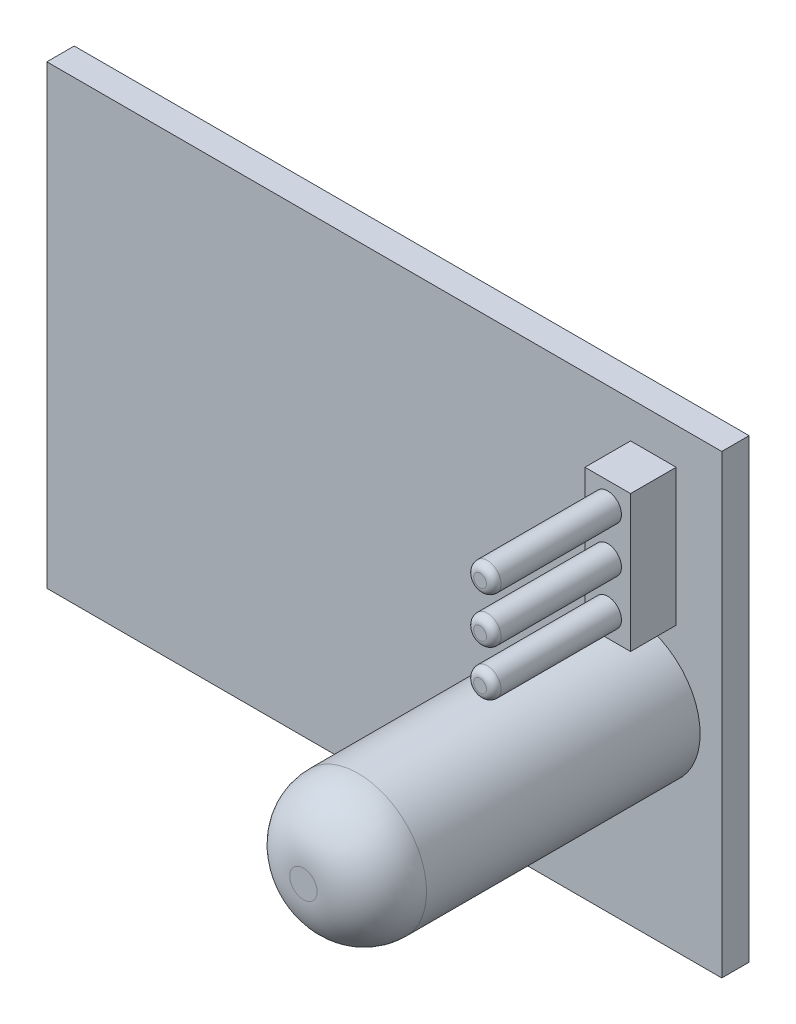
ISO-10303-21;
HEADER;
FILE_DESCRIPTION(('STEP AP214'),'2;1');
FILE_NAME('part.step','',(''),(''),'','','');
FILE_SCHEMA(('AUTOMOTIVE_DESIGN { 1 0 10303 214 1 1 1 1 }'));
ENDSEC;
DATA;
#1=APPLICATION_CONTEXT('core data for automotive mechanical design processes');
#2=APPLICATION_PROTOCOL_DEFINITION('international standard','automotive_design',2000,#1);
#3=PRODUCT_CONTEXT('',#1,'mechanical');
#4=PRODUCT('Part','Part','',(#3));
#5=PRODUCT_RELATED_PRODUCT_CATEGORY('part','',(#4));
#6=PRODUCT_DEFINITION_FORMATION('','',#4);
#7=PRODUCT_DEFINITION_CONTEXT('part definition',#1,'design');
#8=PRODUCT_DEFINITION('design','',#6,#7);
#9=PRODUCT_DEFINITION_SHAPE('','',#8);
#10=(LENGTH_UNIT() NAMED_UNIT(*) SI_UNIT(.MILLI.,.METRE.));
#11=(NAMED_UNIT(*) PLANE_ANGLE_UNIT() SI_UNIT($,.RADIAN.));
#12=(NAMED_UNIT(*) SI_UNIT($,.STERADIAN.) SOLID_ANGLE_UNIT());
#13=UNCERTAINTY_MEASURE_WITH_UNIT(LENGTH_MEASURE(1.E-05),#10,'distance_accuracy_value','');
#14=(GEOMETRIC_REPRESENTATION_CONTEXT(3) GLOBAL_UNCERTAINTY_ASSIGNED_CONTEXT((#13)) GLOBAL_UNIT_ASSIGNED_CONTEXT((#10,
#11,#12)) REPRESENTATION_CONTEXT('',''));
#15=CARTESIAN_POINT('',(0.,0.,0.));
#16=DIRECTION('',(0.,0.,1.));
#17=DIRECTION('',(1.,0.,0.));
#18=AXIS2_PLACEMENT_3D('',#15,#16,#17);
#19=CARTESIAN_POINT('',(0.,0.,4.));
#20=DIRECTION('',(0.,0.,1.));
#21=DIRECTION('',(1.,0.,0.));
#22=AXIS2_PLACEMENT_3D('',#19,#20,#21);
#23=PLANE('',#22);
#24=CARTESIAN_POINT('',(14.75,9.25000000000001,4.));
#25=DIRECTION('',(0.,0.,1.));
#26=DIRECTION('',(1.,0.,0.));
#27=AXIS2_PLACEMENT_3D('',#24,#25,#26);
#28=CIRCLE('',#27,0.75);
#29=CARTESIAN_POINT('',(15.5,9.25000000000001,4.));
#30=VERTEX_POINT('',#29);
#31=EDGE_CURVE('E412',#30,#30,#28,.T.);
#32=ORIENTED_EDGE('',*,*,#31,.F.);
#33=EDGE_LOOP('',(#32));
#34=FACE_BOUND('',#33,.T.);
#35=DIRECTION('',(0.,1.,0.));
#36=VECTOR('',#35,1.);
#37=CARTESIAN_POINT('',(16.,10.5,4.));
#38=LINE('',#37,#36);
#39=CARTESIAN_POINT('',(16.,3.,4.));
#40=VERTEX_POINT('',#39);
#41=CARTESIAN_POINT('',(16.,10.5,4.));
#42=VERTEX_POINT('',#41);
#43=EDGE_CURVE('E119',#40,#42,#38,.T.);
#44=ORIENTED_EDGE('',*,*,#43,.T.);
#45=DIRECTION('',(-1.,0.,0.));
#46=VECTOR('',#45,1.);
#47=CARTESIAN_POINT('',(13.5,10.5,4.));
#48=LINE('',#47,#46);
#49=CARTESIAN_POINT('',(13.5,10.5,4.));
#50=VERTEX_POINT('',#49);
#51=EDGE_CURVE('E108',#42,#50,#48,.T.);
#52=ORIENTED_EDGE('',*,*,#51,.T.);
#53=DIRECTION('',(0.,-1.,0.));
#54=VECTOR('',#53,1.);
#55=CARTESIAN_POINT('',(13.5,10.5,4.));
#56=LINE('',#55,#54);
#57=CARTESIAN_POINT('',(13.5,3.,4.));
#58=VERTEX_POINT('',#57);
#59=EDGE_CURVE('E118',#50,#58,#56,.T.);
#60=ORIENTED_EDGE('',*,*,#59,.T.);
#61=DIRECTION('',(1.,0.,0.));
#62=VECTOR('',#61,1.);
#63=CARTESIAN_POINT('',(13.5,3.,4.));
#64=LINE('',#63,#62);
#65=EDGE_CURVE('E123',#58,#40,#64,.T.);
#66=ORIENTED_EDGE('',*,*,#65,.T.);
#67=EDGE_LOOP('',(#44,#52,#60,#66));
#68=FACE_BOUND('',#67,.T.);
#69=CARTESIAN_POINT('',(14.75,6.75,4.));
#70=DIRECTION('',(0.,0.,1.));
#71=DIRECTION('',(1.,0.,0.));
#72=AXIS2_PLACEMENT_3D('',#69,#70,#71);
#73=CIRCLE('',#72,0.75);
#74=CARTESIAN_POINT('',(15.5,6.75,4.));
#75=VERTEX_POINT('',#74);
#76=EDGE_CURVE('E413',#75,#75,#73,.T.);
#77=ORIENTED_EDGE('',*,*,#76,.F.);
#78=EDGE_LOOP('',(#77));
#79=FACE_BOUND('',#78,.T.);
#80=CARTESIAN_POINT('',(14.75,4.25,4.));
#81=DIRECTION('',(0.,0.,1.));
#82=DIRECTION('',(1.,0.,0.));
#83=AXIS2_PLACEMENT_3D('',#80,#81,#82);
#84=CIRCLE('',#83,0.75);
#85=CARTESIAN_POINT('',(15.5,4.25,4.));
#86=VERTEX_POINT('',#85);
#87=EDGE_CURVE('E169',#86,#86,#84,.T.);
#88=ORIENTED_EDGE('',*,*,#87,.F.);
#89=EDGE_LOOP('',(#88));
#90=FACE_BOUND('',#89,.T.);
#91=ADVANCED_FACE('F33',(#34,#68,#79,#90),#23,.T.);
#92=CARTESIAN_POINT('',(0.,0.,1.5));
#93=DIRECTION('',(0.,0.,1.));
#94=DIRECTION('',(1.,0.,0.));
#95=AXIS2_PLACEMENT_3D('',#92,#93,#94);
#96=PLANE('',#95);
#97=CARTESIAN_POINT('',(13.5646679125898,-1.5,1.5));
#98=DIRECTION('',(0.,0.,1.));
#99=DIRECTION('',(1.,0.,0.));
#100=AXIS2_PLACEMENT_3D('',#97,#98,#99);
#101=CIRCLE('',#100,3.75);
#102=CARTESIAN_POINT('',(17.3146679125898,-1.5,1.5));
#103=VERTEX_POINT('',#102);
#104=EDGE_CURVE('E133',#103,#103,#101,.T.);
#105=ORIENTED_EDGE('',*,*,#104,.F.);
#106=EDGE_LOOP('',(#105));
#107=FACE_BOUND('',#106,.T.);
#108=DIRECTION('',(0.,-1.,0.));
#109=VECTOR('',#108,1.);
#110=CARTESIAN_POINT('',(-18.5,-12.5,1.5));
#111=LINE('',#110,#109);
#112=CARTESIAN_POINT('',(-18.5,12.5,1.5));
#113=VERTEX_POINT('',#112);
#114=CARTESIAN_POINT('',(-18.5,-12.5,1.5));
#115=VERTEX_POINT('',#114);
#116=EDGE_CURVE('E141',#113,#115,#111,.T.);
#117=ORIENTED_EDGE('',*,*,#116,.T.);
#118=DIRECTION('',(1.,0.,0.));
#119=VECTOR('',#118,1.);
#120=CARTESIAN_POINT('',(18.5,-12.5,1.5));
#121=LINE('',#120,#119);
#122=CARTESIAN_POINT('',(18.5,-12.5,1.5));
#123=VERTEX_POINT('',#122);
#124=EDGE_CURVE('E86',#115,#123,#121,.T.);
#125=ORIENTED_EDGE('',*,*,#124,.T.);
#126=DIRECTION('',(0.,1.,0.));
#127=VECTOR('',#126,1.);
#128=CARTESIAN_POINT('',(18.5,-12.5,1.5));
#129=LINE('',#128,#127);
#130=CARTESIAN_POINT('',(18.5,12.5,1.5));
#131=VERTEX_POINT('',#130);
#132=EDGE_CURVE('E144',#123,#131,#129,.T.);
#133=ORIENTED_EDGE('',*,*,#132,.T.);
#134=DIRECTION('',(-1.,0.,0.));
#135=VECTOR('',#134,1.);
#136=CARTESIAN_POINT('',(18.5,12.5,1.5));
#137=LINE('',#136,#135);
#138=EDGE_CURVE('E57',#131,#113,#137,.T.);
#139=ORIENTED_EDGE('',*,*,#138,.T.);
#140=EDGE_LOOP('',(#117,#125,#133,#139));
#141=FACE_BOUND('',#140,.T.);
#142=DIRECTION('',(-1.,0.,0.));
#143=VECTOR('',#142,1.);
#144=CARTESIAN_POINT('',(13.5,10.5,1.5));
#145=LINE('',#144,#143);
#146=CARTESIAN_POINT('',(16.,10.5,1.5));
#147=VERTEX_POINT('',#146);
#148=CARTESIAN_POINT('',(13.5,10.5,1.5));
#149=VERTEX_POINT('',#148);
#150=EDGE_CURVE('E415',#147,#149,#145,.T.);
#151=ORIENTED_EDGE('',*,*,#150,.F.);
#152=DIRECTION('',(0.,1.,0.));
#153=VECTOR('',#152,1.);
#154=CARTESIAN_POINT('',(16.,10.5,1.5));
#155=LINE('',#154,#153);
#156=CARTESIAN_POINT('',(16.,3.,1.5));
#157=VERTEX_POINT('',#156);
#158=EDGE_CURVE('E131',#157,#147,#155,.T.);
#159=ORIENTED_EDGE('',*,*,#158,.F.);
#160=DIRECTION('',(1.,0.,0.));
#161=VECTOR('',#160,1.);
#162=CARTESIAN_POINT('',(13.5,3.,1.5));
#163=LINE('',#162,#161);
#164=CARTESIAN_POINT('',(13.5,3.,1.5));
#165=VERTEX_POINT('',#164);
#166=EDGE_CURVE('E127',#165,#157,#163,.T.);
#167=ORIENTED_EDGE('',*,*,#166,.F.);
#168=DIRECTION('',(0.,-1.,0.));
#169=VECTOR('',#168,1.);
#170=CARTESIAN_POINT('',(13.5,10.5,1.5));
#171=LINE('',#170,#169);
#172=EDGE_CURVE('E424',#149,#165,#171,.T.);
#173=ORIENTED_EDGE('',*,*,#172,.F.);
#174=EDGE_LOOP('',(#151,#159,#167,#173));
#175=FACE_BOUND('',#174,.T.);
#176=ADVANCED_FACE('F198',(#107,#141,#175),#96,.T.);
#177=CARTESIAN_POINT('',(-18.5,-12.5,1.5));
#178=DIRECTION('',(1.,0.,0.));
#179=DIRECTION('',(0.,0.,-1.));
#180=AXIS2_PLACEMENT_3D('',#177,#178,#179);
#181=PLANE('',#180);
#182=DIRECTION('',(0.,-1.,0.));
#183=VECTOR('',#182,1.);
#184=CARTESIAN_POINT('',(-18.5,-12.5,0.));
#185=LINE('',#184,#183);
#186=CARTESIAN_POINT('',(-18.5,12.5,0.));
#187=VERTEX_POINT('',#186);
#188=CARTESIAN_POINT('',(-18.5,-12.5,0.));
#189=VERTEX_POINT('',#188);
#190=EDGE_CURVE('E136',#187,#189,#185,.T.);
#191=ORIENTED_EDGE('',*,*,#190,.T.);
#192=DIRECTION('',(0.,0.,-1.));
#193=VECTOR('',#192,1.);
#194=CARTESIAN_POINT('',(-18.5,-12.5,1.5));
#195=LINE('',#194,#193);
#196=EDGE_CURVE('E161',#115,#189,#195,.T.);
#197=ORIENTED_EDGE('',*,*,#196,.F.);
#198=ORIENTED_EDGE('',*,*,#116,.F.);
#199=DIRECTION('',(0.,0.,-1.));
#200=VECTOR('',#199,1.);
#201=CARTESIAN_POINT('',(-18.5,12.5,1.5));
#202=LINE('',#201,#200);
#203=EDGE_CURVE('E147',#113,#187,#202,.T.);
#204=ORIENTED_EDGE('',*,*,#203,.T.);
#205=EDGE_LOOP('',(#191,#197,#198,#204));
#206=FACE_BOUND('',#205,.T.);
#207=ADVANCED_FACE('F204',(#206),#181,.F.);
#208=CARTESIAN_POINT('',(18.5,-12.5,1.5));
#209=DIRECTION('',(0.,1.,0.));
#210=DIRECTION('',(-1.,0.,0.));
#211=AXIS2_PLACEMENT_3D('',#208,#209,#210);
#212=PLANE('',#211);
#213=DIRECTION('',(1.,0.,0.));
#214=VECTOR('',#213,1.);
#215=CARTESIAN_POINT('',(18.5,-12.5,0.));
#216=LINE('',#215,#214);
#217=CARTESIAN_POINT('',(18.5,-12.5,0.));
#218=VERTEX_POINT('',#217);
#219=EDGE_CURVE('E150',#189,#218,#216,.T.);
#220=ORIENTED_EDGE('',*,*,#219,.T.);
#221=DIRECTION('',(0.,0.,-1.));
#222=VECTOR('',#221,1.);
#223=CARTESIAN_POINT('',(18.5,-12.5,1.5));
#224=LINE('',#223,#222);
#225=EDGE_CURVE('E158',#123,#218,#224,.T.);
#226=ORIENTED_EDGE('',*,*,#225,.F.);
#227=ORIENTED_EDGE('',*,*,#124,.F.);
#228=ORIENTED_EDGE('',*,*,#196,.T.);
#229=EDGE_LOOP('',(#220,#226,#227,#228));
#230=FACE_BOUND('',#229,.T.);
#231=ADVANCED_FACE('F242',(#230),#212,.F.);
#232=CARTESIAN_POINT('',(18.5,-12.5,1.5));
#233=DIRECTION('',(-1.,0.,0.));
#234=DIRECTION('',(0.,0.,1.));
#235=AXIS2_PLACEMENT_3D('',#232,#233,#234);
#236=PLANE('',#235);
#237=DIRECTION('',(0.,1.,0.));
#238=VECTOR('',#237,1.);
#239=CARTESIAN_POINT('',(18.5,-12.5,0.));
#240=LINE('',#239,#238);
#241=CARTESIAN_POINT('',(18.5,12.5,0.));
#242=VERTEX_POINT('',#241);
#243=EDGE_CURVE('E152',#218,#242,#240,.T.);
#244=ORIENTED_EDGE('',*,*,#243,.T.);
#245=DIRECTION('',(0.,0.,-1.));
#246=VECTOR('',#245,1.);
#247=CARTESIAN_POINT('',(18.5,12.5,1.5));
#248=LINE('',#247,#246);
#249=EDGE_CURVE('E156',#131,#242,#248,.T.);
#250=ORIENTED_EDGE('',*,*,#249,.F.);
#251=ORIENTED_EDGE('',*,*,#132,.F.);
#252=ORIENTED_EDGE('',*,*,#225,.T.);
#253=EDGE_LOOP('',(#244,#250,#251,#252));
#254=FACE_BOUND('',#253,.T.);
#255=ADVANCED_FACE('F239',(#254),#236,.F.);
#256=CARTESIAN_POINT('',(18.5,12.5,1.5));
#257=DIRECTION('',(0.,-1.,0.));
#258=DIRECTION('',(1.,0.,0.));
#259=AXIS2_PLACEMENT_3D('',#256,#257,#258);
#260=PLANE('',#259);
#261=DIRECTION('',(-1.,0.,0.));
#262=VECTOR('',#261,1.);
#263=CARTESIAN_POINT('',(18.5,12.5,0.));
#264=LINE('',#263,#262);
#265=EDGE_CURVE('E78',#242,#187,#264,.T.);
#266=ORIENTED_EDGE('',*,*,#265,.T.);
#267=ORIENTED_EDGE('',*,*,#203,.F.);
#268=ORIENTED_EDGE('',*,*,#138,.F.);
#269=ORIENTED_EDGE('',*,*,#249,.T.);
#270=EDGE_LOOP('',(#266,#267,#268,#269));
#271=FACE_BOUND('',#270,.T.);
#272=ADVANCED_FACE('F235',(#271),#260,.F.);
#273=CARTESIAN_POINT('',(0.,0.,0.));
#274=DIRECTION('',(0.,0.,1.));
#275=DIRECTION('',(1.,0.,0.));
#276=AXIS2_PLACEMENT_3D('',#273,#274,#275);
#277=PLANE('',#276);
#278=ORIENTED_EDGE('',*,*,#190,.F.);
#279=ORIENTED_EDGE('',*,*,#265,.F.);
#280=ORIENTED_EDGE('',*,*,#243,.F.);
#281=ORIENTED_EDGE('',*,*,#219,.F.);
#282=EDGE_LOOP('',(#278,#279,#280,#281));
#283=FACE_BOUND('',#282,.T.);
#284=ADVANCED_FACE('F230',(#283),#277,.F.);
#285=CARTESIAN_POINT('',(13.5646679125898,-1.5,19.5));
#286=DIRECTION('',(0.,0.,-1.));
#287=DIRECTION('',(-1.,0.,0.));
#288=AXIS2_PLACEMENT_3D('',#285,#286,#287);
#289=CYLINDRICAL_SURFACE('',#288,3.75);
#290=CARTESIAN_POINT('',(13.5646679125898,-1.5,16.5));
#291=DIRECTION('',(0.,0.,1.));
#292=DIRECTION('',(1.,0.,0.));
#293=AXIS2_PLACEMENT_3D('',#290,#291,#292);
#294=CIRCLE('',#293,3.75);
#295=CARTESIAN_POINT('',(17.3146679125898,-1.5,16.5));
#296=VERTEX_POINT('',#295);
#297=EDGE_CURVE('E166',#296,#296,#294,.F.);
#298=ORIENTED_EDGE('',*,*,#297,.T.);
#299=EDGE_LOOP('',(#298));
#300=FACE_BOUND('',#299,.T.);
#301=ORIENTED_EDGE('',*,*,#104,.T.);
#302=EDGE_LOOP('',(#301));
#303=FACE_BOUND('',#302,.T.);
#304=ADVANCED_FACE('F227',(#300,#303),#289,.T.);
#305=CARTESIAN_POINT('',(13.5646679125898,-1.5,19.5));
#306=DIRECTION('',(0.,0.,1.));
#307=DIRECTION('',(1.,0.,0.));
#308=AXIS2_PLACEMENT_3D('',#305,#306,#307);
#309=PLANE('',#308);
#310=CARTESIAN_POINT('',(13.5646679125898,-1.5,19.5));
#311=DIRECTION('',(0.,0.,1.));
#312=DIRECTION('',(1.,0.,0.));
#313=AXIS2_PLACEMENT_3D('',#310,#311,#312);
#314=CIRCLE('',#313,0.75);
#315=CARTESIAN_POINT('',(14.3146679125898,-1.5,19.5));
#316=VERTEX_POINT('',#315);
#317=EDGE_CURVE('E163',#316,#316,#314,.T.);
#318=ORIENTED_EDGE('',*,*,#317,.T.);
#319=EDGE_LOOP('',(#318));
#320=FACE_BOUND('',#319,.T.);
#321=ADVANCED_FACE('F224',(#320),#309,.T.);
#322=CARTESIAN_POINT('',(13.5646679125898,-1.5,16.5));
#323=DIRECTION('',(0.,0.,1.));
#324=DIRECTION('',(1.,0.,0.));
#325=AXIS2_PLACEMENT_3D('',#322,#323,#324);
#326=DEGENERATE_TOROIDAL_SURFACE('',#325,0.75,3.,.T.);
#327=ORIENTED_EDGE('',*,*,#297,.F.);
#328=EDGE_LOOP('',(#327));
#329=FACE_BOUND('',#328,.T.);
#330=ORIENTED_EDGE('',*,*,#317,.F.);
#331=EDGE_LOOP('',(#330));
#332=FACE_BOUND('',#331,.T.);
#333=ADVANCED_FACE('F223',(#329,#332),#326,.T.);
#334=CARTESIAN_POINT('',(16.,10.5,4.));
#335=DIRECTION('',(-1.,0.,0.));
#336=DIRECTION('',(0.,-1.,0.));
#337=AXIS2_PLACEMENT_3D('',#334,#335,#336);
#338=PLANE('',#337);
#339=ORIENTED_EDGE('',*,*,#158,.T.);
#340=DIRECTION('',(0.,0.,-1.));
#341=VECTOR('',#340,1.);
#342=CARTESIAN_POINT('',(16.,10.5,4.));
#343=LINE('',#342,#341);
#344=EDGE_CURVE('E112',#42,#147,#343,.T.);
#345=ORIENTED_EDGE('',*,*,#344,.F.);
#346=ORIENTED_EDGE('',*,*,#43,.F.);
#347=DIRECTION('',(0.,0.,-1.));
#348=VECTOR('',#347,1.);
#349=CARTESIAN_POINT('',(16.,3.,4.));
#350=LINE('',#349,#348);
#351=EDGE_CURVE('E421',#40,#157,#350,.T.);
#352=ORIENTED_EDGE('',*,*,#351,.T.);
#353=EDGE_LOOP('',(#339,#345,#346,#352));
#354=FACE_BOUND('',#353,.T.);
#355=ADVANCED_FACE('F129',(#354),#338,.F.);
#356=CARTESIAN_POINT('',(13.5,10.5,4.));
#357=DIRECTION('',(0.,-1.,0.));
#358=DIRECTION('',(1.,0.,0.));
#359=AXIS2_PLACEMENT_3D('',#356,#357,#358);
#360=PLANE('',#359);
#361=ORIENTED_EDGE('',*,*,#150,.T.);
#362=DIRECTION('',(0.,0.,-1.));
#363=VECTOR('',#362,1.);
#364=CARTESIAN_POINT('',(13.5,10.5,4.));
#365=LINE('',#364,#363);
#366=EDGE_CURVE('E115',#50,#149,#365,.T.);
#367=ORIENTED_EDGE('',*,*,#366,.F.);
#368=ORIENTED_EDGE('',*,*,#51,.F.);
#369=ORIENTED_EDGE('',*,*,#344,.T.);
#370=EDGE_LOOP('',(#361,#367,#368,#369));
#371=FACE_BOUND('',#370,.T.);
#372=ADVANCED_FACE('F110',(#371),#360,.F.);
#373=CARTESIAN_POINT('',(13.5,10.5,4.));
#374=DIRECTION('',(1.,0.,0.));
#375=DIRECTION('',(0.,1.,0.));
#376=AXIS2_PLACEMENT_3D('',#373,#374,#375);
#377=PLANE('',#376);
#378=ORIENTED_EDGE('',*,*,#172,.T.);
#379=DIRECTION('',(0.,0.,-1.));
#380=VECTOR('',#379,1.);
#381=CARTESIAN_POINT('',(13.5,3.,4.));
#382=LINE('',#381,#380);
#383=EDGE_CURVE('E48',#58,#165,#382,.T.);
#384=ORIENTED_EDGE('',*,*,#383,.F.);
#385=ORIENTED_EDGE('',*,*,#59,.F.);
#386=ORIENTED_EDGE('',*,*,#366,.T.);
#387=EDGE_LOOP('',(#378,#384,#385,#386));
#388=FACE_BOUND('',#387,.T.);
#389=ADVANCED_FACE('F215',(#388),#377,.F.);
#390=CARTESIAN_POINT('',(13.5,3.,4.));
#391=DIRECTION('',(0.,1.,0.));
#392=DIRECTION('',(0.,0.,1.));
#393=AXIS2_PLACEMENT_3D('',#390,#391,#392);
#394=PLANE('',#393);
#395=ORIENTED_EDGE('',*,*,#166,.T.);
#396=ORIENTED_EDGE('',*,*,#351,.F.);
#397=ORIENTED_EDGE('',*,*,#65,.F.);
#398=ORIENTED_EDGE('',*,*,#383,.T.);
#399=EDGE_LOOP('',(#395,#396,#397,#398));
#400=FACE_BOUND('',#399,.T.);
#401=ADVANCED_FACE('F212',(#400),#394,.F.);
#402=CARTESIAN_POINT('',(14.75,9.25000000000001,11.));
#403=DIRECTION('',(0.,0.,-1.));
#404=DIRECTION('',(-1.,0.,0.));
#405=AXIS2_PLACEMENT_3D('',#402,#403,#404);
#406=CYLINDRICAL_SURFACE('',#405,0.75);
#407=CARTESIAN_POINT('',(14.75,9.25000000000001,10.6));
#408=DIRECTION('',(0.,0.,1.));
#409=DIRECTION('',(1.,0.,0.));
#410=AXIS2_PLACEMENT_3D('',#407,#408,#409);
#411=CIRCLE('',#410,0.75);
#412=CARTESIAN_POINT('',(15.5,9.25000000000001,10.6));
#413=VERTEX_POINT('',#412);
#414=EDGE_CURVE('E175',#413,#413,#411,.F.);
#415=ORIENTED_EDGE('',*,*,#414,.T.);
#416=EDGE_LOOP('',(#415));
#417=FACE_BOUND('',#416,.T.);
#418=ORIENTED_EDGE('',*,*,#31,.T.);
#419=EDGE_LOOP('',(#418));
#420=FACE_BOUND('',#419,.T.);
#421=ADVANCED_FACE('F210',(#417,#420),#406,.T.);
#422=CARTESIAN_POINT('',(14.75,9.25000000000001,11.));
#423=DIRECTION('',(0.,0.,1.));
#424=DIRECTION('',(1.,0.,0.));
#425=AXIS2_PLACEMENT_3D('',#422,#423,#424);
#426=PLANE('',#425);
#427=CARTESIAN_POINT('',(14.75,9.25000000000001,11.));
#428=DIRECTION('',(0.,0.,1.));
#429=DIRECTION('',(1.,0.,0.));
#430=AXIS2_PLACEMENT_3D('',#427,#428,#429);
#431=CIRCLE('',#430,0.35);
#432=CARTESIAN_POINT('',(15.1,9.25000000000001,11.));
#433=VERTEX_POINT('',#432);
#434=EDGE_CURVE('E172',#433,#433,#431,.T.);
#435=ORIENTED_EDGE('',*,*,#434,.T.);
#436=EDGE_LOOP('',(#435));
#437=FACE_BOUND('',#436,.T.);
#438=ADVANCED_FACE('F268',(#437),#426,.T.);
#439=CARTESIAN_POINT('',(14.75,6.75,11.));
#440=DIRECTION('',(0.,0.,-1.));
#441=DIRECTION('',(-1.,0.,0.));
#442=AXIS2_PLACEMENT_3D('',#439,#440,#441);
#443=CYLINDRICAL_SURFACE('',#442,0.75);
#444=CARTESIAN_POINT('',(14.75,6.75,10.6));
#445=DIRECTION('',(0.,0.,1.));
#446=DIRECTION('',(1.,0.,0.));
#447=AXIS2_PLACEMENT_3D('',#444,#445,#446);
#448=CIRCLE('',#447,0.75);
#449=CARTESIAN_POINT('',(15.5,6.75,10.6));
#450=VERTEX_POINT('',#449);
#451=EDGE_CURVE('E11',#450,#450,#448,.F.);
#452=ORIENTED_EDGE('',*,*,#451,.T.);
#453=EDGE_LOOP('',(#452));
#454=FACE_BOUND('',#453,.T.);
#455=ORIENTED_EDGE('',*,*,#76,.T.);
#456=EDGE_LOOP('',(#455));
#457=FACE_BOUND('',#456,.T.);
#458=ADVANCED_FACE('F270',(#454,#457),#443,.T.);
#459=CARTESIAN_POINT('',(14.75,6.75,11.));
#460=DIRECTION('',(0.,0.,1.));
#461=DIRECTION('',(1.,0.,0.));
#462=AXIS2_PLACEMENT_3D('',#459,#460,#461);
#463=PLANE('',#462);
#464=CARTESIAN_POINT('',(14.75,6.75,11.));
#465=DIRECTION('',(0.,0.,1.));
#466=DIRECTION('',(1.,0.,0.));
#467=AXIS2_PLACEMENT_3D('',#464,#465,#466);
#468=CIRCLE('',#467,0.35);
#469=CARTESIAN_POINT('',(15.1,6.75,11.));
#470=VERTEX_POINT('',#469);
#471=EDGE_CURVE('E41',#470,#470,#468,.T.);
#472=ORIENTED_EDGE('',*,*,#471,.T.);
#473=EDGE_LOOP('',(#472));
#474=FACE_BOUND('',#473,.T.);
#475=ADVANCED_FACE('F186',(#474),#463,.T.);
#476=CARTESIAN_POINT('',(14.75,4.25,11.));
#477=DIRECTION('',(0.,0.,1.));
#478=DIRECTION('',(1.,0.,0.));
#479=AXIS2_PLACEMENT_3D('',#476,#477,#478);
#480=PLANE('',#479);
#481=CARTESIAN_POINT('',(14.75,4.25,11.));
#482=DIRECTION('',(0.,0.,1.));
#483=DIRECTION('',(1.,0.,0.));
#484=AXIS2_PLACEMENT_3D('',#481,#482,#483);
#485=CIRCLE('',#484,0.35);
#486=CARTESIAN_POINT('',(15.1,4.25,11.));
#487=VERTEX_POINT('',#486);
#488=EDGE_CURVE('E178',#487,#487,#485,.T.);
#489=ORIENTED_EDGE('',*,*,#488,.T.);
#490=EDGE_LOOP('',(#489));
#491=FACE_BOUND('',#490,.T.);
#492=ADVANCED_FACE('F255',(#491),#480,.T.);
#493=CARTESIAN_POINT('',(14.75,4.25,11.));
#494=DIRECTION('',(0.,0.,-1.));
#495=DIRECTION('',(-1.,0.,0.));
#496=AXIS2_PLACEMENT_3D('',#493,#494,#495);
#497=CYLINDRICAL_SURFACE('',#496,0.75);
#498=CARTESIAN_POINT('',(14.75,4.25,10.6));
#499=DIRECTION('',(0.,0.,1.));
#500=DIRECTION('',(1.,0.,0.));
#501=AXIS2_PLACEMENT_3D('',#498,#499,#500);
#502=CIRCLE('',#501,0.75);
#503=CARTESIAN_POINT('',(15.5,4.25,10.6));
#504=VERTEX_POINT('',#503);
#505=EDGE_CURVE('E181',#504,#504,#502,.F.);
#506=ORIENTED_EDGE('',*,*,#505,.T.);
#507=EDGE_LOOP('',(#506));
#508=FACE_BOUND('',#507,.T.);
#509=ORIENTED_EDGE('',*,*,#87,.T.);
#510=EDGE_LOOP('',(#509));
#511=FACE_BOUND('',#510,.T.);
#512=ADVANCED_FACE('F252',(#508,#511),#497,.T.);
#513=CARTESIAN_POINT('',(14.75,9.25000000000001,10.6));
#514=DIRECTION('',(0.,0.,1.));
#515=DIRECTION('',(1.,0.,0.));
#516=AXIS2_PLACEMENT_3D('',#513,#514,#515);
#517=DEGENERATE_TOROIDAL_SURFACE('',#516,0.35,0.4,.T.);
#518=ORIENTED_EDGE('',*,*,#414,.F.);
#519=EDGE_LOOP('',(#518));
#520=FACE_BOUND('',#519,.T.);
#521=ORIENTED_EDGE('',*,*,#434,.F.);
#522=EDGE_LOOP('',(#521));
#523=FACE_BOUND('',#522,.T.);
#524=ADVANCED_FACE('F194',(#520,#523),#517,.T.);
#525=CARTESIAN_POINT('',(14.75,4.25,10.6));
#526=DIRECTION('',(0.,0.,1.));
#527=DIRECTION('',(1.,0.,0.));
#528=AXIS2_PLACEMENT_3D('',#525,#526,#527);
#529=DEGENERATE_TOROIDAL_SURFACE('',#528,0.35,0.4,.T.);
#530=ORIENTED_EDGE('',*,*,#505,.F.);
#531=EDGE_LOOP('',(#530));
#532=FACE_BOUND('',#531,.T.);
#533=ORIENTED_EDGE('',*,*,#488,.F.);
#534=EDGE_LOOP('',(#533));
#535=FACE_BOUND('',#534,.T.);
#536=ADVANCED_FACE('F189',(#532,#535),#529,.T.);
#537=CARTESIAN_POINT('',(14.75,6.75,10.6));
#538=DIRECTION('',(0.,0.,1.));
#539=DIRECTION('',(1.,0.,0.));
#540=AXIS2_PLACEMENT_3D('',#537,#538,#539);
#541=DEGENERATE_TOROIDAL_SURFACE('',#540,0.35,0.4,.T.);
#542=ORIENTED_EDGE('',*,*,#451,.F.);
#543=EDGE_LOOP('',(#542));
#544=FACE_BOUND('',#543,.T.);
#545=ORIENTED_EDGE('',*,*,#471,.F.);
#546=EDGE_LOOP('',(#545));
#547=FACE_BOUND('',#546,.T.);
#548=ADVANCED_FACE('F35',(#544,#547),#541,.T.);
#549=CLOSED_SHELL('',(#91,#176,#207,#231,#255,#272,#284,#304,#321,#333,#355,#372,#389,#401,#421,
#438,#458,#475,#492,#512,#524,#536,#548));
#550=MANIFOLD_SOLID_BREP('B2',#549);
#551=ADVANCED_BREP_SHAPE_REPRESENTATION('',(#18,#550),#14);
#552=SHAPE_DEFINITION_REPRESENTATION(#9,#551);
ENDSEC;
END-ISO-10303-21;
